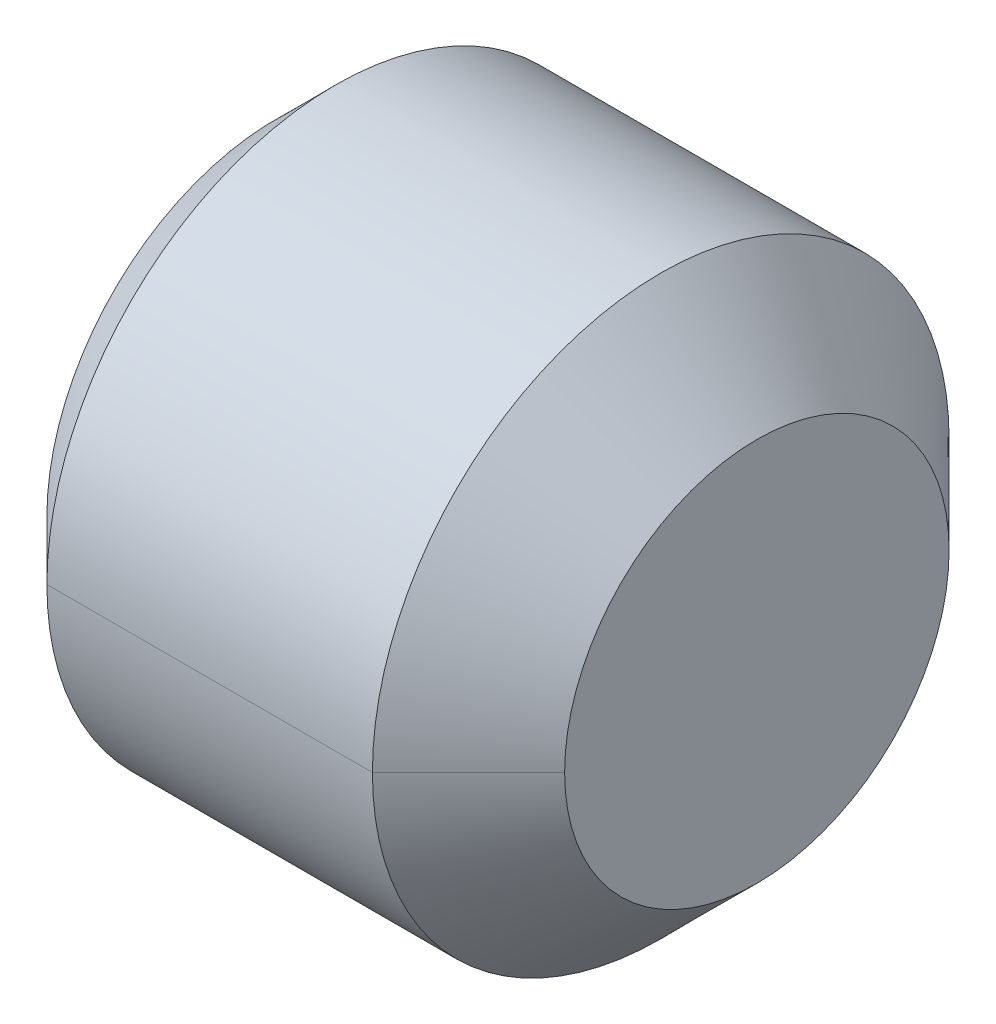
ISO-10303-21;
HEADER;
FILE_DESCRIPTION(('STEP AP214'),'2;1');
FILE_NAME('part.step','',(''),(''),'','','');
FILE_SCHEMA(('AUTOMOTIVE_DESIGN { 1 0 10303 214 1 1 1 1 }'));
ENDSEC;
DATA;
#1=APPLICATION_CONTEXT('core data for automotive mechanical design processes');
#2=APPLICATION_PROTOCOL_DEFINITION('international standard','automotive_design',2000,#1);
#3=PRODUCT_CONTEXT('',#1,'mechanical');
#4=PRODUCT('Part','Part','',(#3));
#5=PRODUCT_RELATED_PRODUCT_CATEGORY('part','',(#4));
#6=PRODUCT_DEFINITION_FORMATION('','',#4);
#7=PRODUCT_DEFINITION_CONTEXT('part definition',#1,'design');
#8=PRODUCT_DEFINITION('design','',#6,#7);
#9=PRODUCT_DEFINITION_SHAPE('','',#8);
#10=(LENGTH_UNIT() NAMED_UNIT(*) SI_UNIT(.MILLI.,.METRE.));
#11=(NAMED_UNIT(*) PLANE_ANGLE_UNIT() SI_UNIT($,.RADIAN.));
#12=(NAMED_UNIT(*) SI_UNIT($,.STERADIAN.) SOLID_ANGLE_UNIT());
#13=UNCERTAINTY_MEASURE_WITH_UNIT(LENGTH_MEASURE(1.E-05),#10,'distance_accuracy_value','');
#14=(GEOMETRIC_REPRESENTATION_CONTEXT(3) GLOBAL_UNCERTAINTY_ASSIGNED_CONTEXT((#13)) GLOBAL_UNIT_ASSIGNED_CONTEXT((#10,
#11,#12)) REPRESENTATION_CONTEXT('',''));
#15=CARTESIAN_POINT('',(0.,0.,0.));
#16=DIRECTION('',(0.,0.,1.));
#17=DIRECTION('',(1.,0.,0.));
#18=AXIS2_PLACEMENT_3D('',#15,#16,#17);
#19=CARTESIAN_POINT('',(-3.,0.,0.));
#20=DIRECTION('',(-1.,0.,0.));
#21=DIRECTION('',(0.,0.,1.));
#22=AXIS2_PLACEMENT_3D('',#19,#20,#21);
#23=PLANE('',#22);
#24=DIRECTION('',(0.,0.866025403784433,0.500000000000009));
#25=VECTOR('',#24,1.);
#26=CARTESIAN_POINT('',(-3.,-1.5,0.86602540378444));
#27=LINE('',#26,#25);
#28=CARTESIAN_POINT('',(-3.,-1.5,0.86602540378444));
#29=VERTEX_POINT('',#28);
#30=CARTESIAN_POINT('',(-3.,-0.750000000000019,1.29903810567666));
#31=VERTEX_POINT('',#30);
#32=EDGE_CURVE('E11',#29,#31,#27,.T.);
#33=ORIENTED_EDGE('',*,*,#32,.T.);
#34=CARTESIAN_POINT('',(-3.,0.,0.));
#35=DIRECTION('',(1.,0.,0.));
#36=DIRECTION('',(0.,0.,1.));
#37=AXIS2_PLACEMENT_3D('',#34,#35,#36);
#38=CIRCLE('',#37,1.5);
#39=CARTESIAN_POINT('',(-3.,-1.5,0.));
#40=VERTEX_POINT('',#39);
#41=EDGE_CURVE('E25',#31,#40,#38,.T.);
#42=ORIENTED_EDGE('',*,*,#41,.T.);
#43=DIRECTION('',(0.,0.,1.));
#44=VECTOR('',#43,1.);
#45=CARTESIAN_POINT('',(-3.,-1.5,-0.86602540378444));
#46=LINE('',#45,#44);
#47=EDGE_CURVE('E334',#40,#29,#46,.T.);
#48=ORIENTED_EDGE('',*,*,#47,.T.);
#49=EDGE_LOOP('',(#33,#42,#48));
#50=FACE_BOUND('',#49,.T.);
#51=ADVANCED_FACE('F17',(#50),#23,.T.);
#52=CARTESIAN_POINT('',(-3.,-1.5,-0.86602540378444));
#53=DIRECTION('',(0.,-1.,0.));
#54=DIRECTION('',(0.,0.,-1.));
#55=AXIS2_PLACEMENT_3D('',#52,#53,#54);
#56=PLANE('',#55);
#57=DIRECTION('',(0.,0.,1.));
#58=VECTOR('',#57,1.);
#59=CARTESIAN_POINT('',(-5.,-1.5,-0.86602540378444));
#60=LINE('',#59,#58);
#61=CARTESIAN_POINT('',(-5.,-1.5,-0.86602540378444));
#62=VERTEX_POINT('',#61);
#63=CARTESIAN_POINT('',(-5.,-1.5,0.86602540378444));
#64=VERTEX_POINT('',#63);
#65=EDGE_CURVE('E330',#62,#64,#60,.T.);
#66=ORIENTED_EDGE('',*,*,#65,.T.);
#67=DIRECTION('',(-1.,0.,0.));
#68=VECTOR('',#67,1.);
#69=CARTESIAN_POINT('',(-3.,-1.5,0.86602540378444));
#70=LINE('',#69,#68);
#71=EDGE_CURVE('E325',#29,#64,#70,.T.);
#72=ORIENTED_EDGE('',*,*,#71,.F.);
#73=ORIENTED_EDGE('',*,*,#47,.F.);
#74=DIRECTION('',(0.,0.,1.));
#75=VECTOR('',#74,1.);
#76=CARTESIAN_POINT('',(-3.,-1.5,-0.86602540378444));
#77=LINE('',#76,#75);
#78=CARTESIAN_POINT('',(-3.,-1.5,-0.86602540378444));
#79=VERTEX_POINT('',#78);
#80=EDGE_CURVE('E320',#79,#40,#77,.T.);
#81=ORIENTED_EDGE('',*,*,#80,.F.);
#82=DIRECTION('',(-1.,0.,0.));
#83=VECTOR('',#82,1.);
#84=CARTESIAN_POINT('',(-3.,-1.5,-0.86602540378444));
#85=LINE('',#84,#83);
#86=EDGE_CURVE('E316',#79,#62,#85,.T.);
#87=ORIENTED_EDGE('',*,*,#86,.T.);
#88=EDGE_LOOP('',(#66,#72,#73,#81,#87));
#89=FACE_BOUND('',#88,.T.);
#90=ADVANCED_FACE('F345',(#89),#56,.F.);
#91=CARTESIAN_POINT('',(-3.,0.,-1.7320508075689));
#92=DIRECTION('',(0.,-0.500000000000009,-0.866025403784434));
#93=DIRECTION('',(0.,0.866025403784434,-0.500000000000009));
#94=AXIS2_PLACEMENT_3D('',#91,#92,#93);
#95=PLANE('',#94);
#96=DIRECTION('',(0.,-0.866025403784433,0.500000000000009));
#97=VECTOR('',#96,1.);
#98=CARTESIAN_POINT('',(-5.,0.,-1.7320508075689));
#99=LINE('',#98,#97);
#100=CARTESIAN_POINT('',(-5.,0.,-1.7320508075689));
#101=VERTEX_POINT('',#100);
#102=EDGE_CURVE('E311',#101,#62,#99,.T.);
#103=ORIENTED_EDGE('',*,*,#102,.T.);
#104=ORIENTED_EDGE('',*,*,#86,.F.);
#105=DIRECTION('',(0.,-0.866025403784433,0.500000000000009));
#106=VECTOR('',#105,1.);
#107=CARTESIAN_POINT('',(-3.,0.,-1.7320508075689));
#108=LINE('',#107,#106);
#109=CARTESIAN_POINT('',(-3.,-0.750000000000014,-1.29903810567665));
#110=VERTEX_POINT('',#109);
#111=EDGE_CURVE('E306',#110,#79,#108,.T.);
#112=ORIENTED_EDGE('',*,*,#111,.F.);
#113=DIRECTION('',(0.,-0.866025403784433,0.500000000000009));
#114=VECTOR('',#113,1.);
#115=CARTESIAN_POINT('',(-3.,0.,-1.7320508075689));
#116=LINE('',#115,#114);
#117=CARTESIAN_POINT('',(-3.,0.,-1.7320508075689));
#118=VERTEX_POINT('',#117);
#119=EDGE_CURVE('E301',#118,#110,#116,.T.);
#120=ORIENTED_EDGE('',*,*,#119,.F.);
#121=DIRECTION('',(-1.,0.,0.));
#122=VECTOR('',#121,1.);
#123=CARTESIAN_POINT('',(-3.,0.,-1.7320508075689));
#124=LINE('',#123,#122);
#125=EDGE_CURVE('E297',#118,#101,#124,.T.);
#126=ORIENTED_EDGE('',*,*,#125,.T.);
#127=EDGE_LOOP('',(#103,#104,#112,#120,#126));
#128=FACE_BOUND('',#127,.T.);
#129=ADVANCED_FACE('F363',(#128),#95,.F.);
#130=CARTESIAN_POINT('',(-3.,1.5,-0.86602540378444));
#131=DIRECTION('',(0.,0.500000000000009,-0.866025403784434));
#132=DIRECTION('',(0.,0.866025403784434,0.500000000000009));
#133=AXIS2_PLACEMENT_3D('',#130,#131,#132);
#134=PLANE('',#133);
#135=DIRECTION('',(0.,-0.866025403784433,-0.500000000000009));
#136=VECTOR('',#135,1.);
#137=CARTESIAN_POINT('',(-5.,1.5,-0.86602540378444));
#138=LINE('',#137,#136);
#139=CARTESIAN_POINT('',(-5.,1.5,-0.86602540378444));
#140=VERTEX_POINT('',#139);
#141=EDGE_CURVE('E292',#140,#101,#138,.T.);
#142=ORIENTED_EDGE('',*,*,#141,.T.);
#143=ORIENTED_EDGE('',*,*,#125,.F.);
#144=DIRECTION('',(0.,-0.866025403784433,-0.500000000000009));
#145=VECTOR('',#144,1.);
#146=CARTESIAN_POINT('',(-3.,1.5,-0.86602540378444));
#147=LINE('',#146,#145);
#148=CARTESIAN_POINT('',(-3.,0.750000000000014,-1.29903810567665));
#149=VERTEX_POINT('',#148);
#150=EDGE_CURVE('E287',#149,#118,#147,.T.);
#151=ORIENTED_EDGE('',*,*,#150,.F.);
#152=DIRECTION('',(0.,-0.866025403784433,-0.500000000000009));
#153=VECTOR('',#152,1.);
#154=CARTESIAN_POINT('',(-3.,1.5,-0.86602540378444));
#155=LINE('',#154,#153);
#156=CARTESIAN_POINT('',(-3.,1.5,-0.86602540378444));
#157=VERTEX_POINT('',#156);
#158=EDGE_CURVE('E282',#157,#149,#155,.T.);
#159=ORIENTED_EDGE('',*,*,#158,.F.);
#160=DIRECTION('',(-1.,0.,0.));
#161=VECTOR('',#160,1.);
#162=CARTESIAN_POINT('',(-3.,1.5,-0.86602540378444));
#163=LINE('',#162,#161);
#164=EDGE_CURVE('E278',#157,#140,#163,.T.);
#165=ORIENTED_EDGE('',*,*,#164,.T.);
#166=EDGE_LOOP('',(#142,#143,#151,#159,#165));
#167=FACE_BOUND('',#166,.T.);
#168=ADVANCED_FACE('F383',(#167),#134,.F.);
#169=CARTESIAN_POINT('',(-3.,1.5,0.86602540378444));
#170=DIRECTION('',(0.,1.,0.));
#171=DIRECTION('',(0.,0.,1.));
#172=AXIS2_PLACEMENT_3D('',#169,#170,#171);
#173=PLANE('',#172);
#174=DIRECTION('',(-1.,0.,0.));
#175=VECTOR('',#174,1.);
#176=CARTESIAN_POINT('',(-3.,1.5,0.86602540378444));
#177=LINE('',#176,#175);
#178=CARTESIAN_POINT('',(-3.,1.5,0.86602540378444));
#179=VERTEX_POINT('',#178);
#180=CARTESIAN_POINT('',(-5.,1.5,0.86602540378444));
#181=VERTEX_POINT('',#180);
#182=EDGE_CURVE('E274',#179,#181,#177,.T.);
#183=ORIENTED_EDGE('',*,*,#182,.T.);
#184=DIRECTION('',(0.,0.,1.));
#185=VECTOR('',#184,1.);
#186=CARTESIAN_POINT('',(-5.,1.5,0.));
#187=LINE('',#186,#185);
#188=EDGE_CURVE('E269',#140,#181,#187,.T.);
#189=ORIENTED_EDGE('',*,*,#188,.F.);
#190=ORIENTED_EDGE('',*,*,#164,.F.);
#191=DIRECTION('',(0.,0.,-1.));
#192=VECTOR('',#191,1.);
#193=CARTESIAN_POINT('',(-3.,1.5,0.86602540378444));
#194=LINE('',#193,#192);
#195=CARTESIAN_POINT('',(-3.,1.5,0.));
#196=VERTEX_POINT('',#195);
#197=EDGE_CURVE('E264',#196,#157,#194,.T.);
#198=ORIENTED_EDGE('',*,*,#197,.F.);
#199=DIRECTION('',(0.,0.,-1.));
#200=VECTOR('',#199,1.);
#201=CARTESIAN_POINT('',(-3.,1.5,0.86602540378444));
#202=LINE('',#201,#200);
#203=EDGE_CURVE('E259',#179,#196,#202,.T.);
#204=ORIENTED_EDGE('',*,*,#203,.F.);
#205=EDGE_LOOP('',(#183,#189,#190,#198,#204));
#206=FACE_BOUND('',#205,.T.);
#207=ADVANCED_FACE('F386',(#206),#173,.F.);
#208=CARTESIAN_POINT('',(-3.,0.,0.));
#209=DIRECTION('',(-1.,0.,0.));
#210=DIRECTION('',(0.,0.,1.));
#211=AXIS2_PLACEMENT_3D('',#208,#209,#210);
#212=PLANE('',#211);
#213=ORIENTED_EDGE('',*,*,#203,.T.);
#214=CARTESIAN_POINT('',(-3.,0.,0.));
#215=DIRECTION('',(1.,0.,0.));
#216=DIRECTION('',(0.,0.,-1.));
#217=AXIS2_PLACEMENT_3D('',#214,#215,#216);
#218=CIRCLE('',#217,1.5);
#219=CARTESIAN_POINT('',(-3.,0.750000000000014,1.29903810567665));
#220=VERTEX_POINT('',#219);
#221=EDGE_CURVE('E255',#196,#220,#218,.T.);
#222=ORIENTED_EDGE('',*,*,#221,.T.);
#223=DIRECTION('',(0.,0.866025403784433,-0.500000000000009));
#224=VECTOR('',#223,1.);
#225=CARTESIAN_POINT('',(-3.,0.,1.7320508075689));
#226=LINE('',#225,#224);
#227=EDGE_CURVE('E250',#220,#179,#226,.T.);
#228=ORIENTED_EDGE('',*,*,#227,.T.);
#229=EDGE_LOOP('',(#213,#222,#228));
#230=FACE_BOUND('',#229,.T.);
#231=ADVANCED_FACE('F388',(#230),#212,.T.);
#232=CARTESIAN_POINT('',(-3.,0.,1.7320508075689));
#233=DIRECTION('',(0.,0.500000000000009,0.866025403784434));
#234=DIRECTION('',(0.,-0.866025403784434,0.500000000000009));
#235=AXIS2_PLACEMENT_3D('',#232,#233,#234);
#236=PLANE('',#235);
#237=DIRECTION('',(0.,0.866025403784433,-0.500000000000009));
#238=VECTOR('',#237,1.);
#239=CARTESIAN_POINT('',(-5.,0.,1.7320508075689));
#240=LINE('',#239,#238);
#241=CARTESIAN_POINT('',(-5.,0.,1.7320508075689));
#242=VERTEX_POINT('',#241);
#243=EDGE_CURVE('E245',#242,#181,#240,.T.);
#244=ORIENTED_EDGE('',*,*,#243,.T.);
#245=ORIENTED_EDGE('',*,*,#182,.F.);
#246=ORIENTED_EDGE('',*,*,#227,.F.);
#247=DIRECTION('',(0.,0.866025403784433,-0.500000000000009));
#248=VECTOR('',#247,1.);
#249=CARTESIAN_POINT('',(-3.,0.,1.7320508075689));
#250=LINE('',#249,#248);
#251=CARTESIAN_POINT('',(-3.,0.,1.7320508075689));
#252=VERTEX_POINT('',#251);
#253=EDGE_CURVE('E240',#252,#220,#250,.T.);
#254=ORIENTED_EDGE('',*,*,#253,.F.);
#255=DIRECTION('',(-1.,0.,0.));
#256=VECTOR('',#255,1.);
#257=CARTESIAN_POINT('',(-3.,0.,1.7320508075689));
#258=LINE('',#257,#256);
#259=EDGE_CURVE('E236',#252,#242,#258,.T.);
#260=ORIENTED_EDGE('',*,*,#259,.T.);
#261=EDGE_LOOP('',(#244,#245,#246,#254,#260));
#262=FACE_BOUND('',#261,.T.);
#263=ADVANCED_FACE('F372',(#262),#236,.F.);
#264=CARTESIAN_POINT('',(-3.,-1.5,0.86602540378444));
#265=DIRECTION('',(0.,-0.500000000000009,0.866025403784434));
#266=DIRECTION('',(0.,-0.866025403784434,-0.500000000000009));
#267=AXIS2_PLACEMENT_3D('',#264,#265,#266);
#268=PLANE('',#267);
#269=DIRECTION('',(0.,0.866025403784433,0.500000000000009));
#270=VECTOR('',#269,1.);
#271=CARTESIAN_POINT('',(-5.,-1.5,0.86602540378444));
#272=LINE('',#271,#270);
#273=EDGE_CURVE('E231',#64,#242,#272,.T.);
#274=ORIENTED_EDGE('',*,*,#273,.T.);
#275=ORIENTED_EDGE('',*,*,#259,.F.);
#276=DIRECTION('',(0.,0.866025403784433,0.500000000000009));
#277=VECTOR('',#276,1.);
#278=CARTESIAN_POINT('',(-3.,-1.5,0.86602540378444));
#279=LINE('',#278,#277);
#280=EDGE_CURVE('E226',#31,#252,#279,.T.);
#281=ORIENTED_EDGE('',*,*,#280,.F.);
#282=ORIENTED_EDGE('',*,*,#32,.F.);
#283=ORIENTED_EDGE('',*,*,#71,.T.);
#284=EDGE_LOOP('',(#274,#275,#281,#282,#283));
#285=FACE_BOUND('',#284,.T.);
#286=ADVANCED_FACE('F349',(#285),#268,.F.);
#287=CARTESIAN_POINT('',(-3.,0.,0.));
#288=DIRECTION('',(-1.,0.,0.));
#289=DIRECTION('',(0.,0.,1.));
#290=AXIS2_PLACEMENT_3D('',#287,#288,#289);
#291=PLANE('',#290);
#292=ORIENTED_EDGE('',*,*,#253,.T.);
#293=CARTESIAN_POINT('',(-3.,0.,0.));
#294=DIRECTION('',(1.,0.,0.));
#295=DIRECTION('',(0.,0.,1.));
#296=AXIS2_PLACEMENT_3D('',#293,#294,#295);
#297=CIRCLE('',#296,1.5);
#298=CARTESIAN_POINT('',(-3.,0.,1.5));
#299=VERTEX_POINT('',#298);
#300=EDGE_CURVE('E222',#220,#299,#297,.T.);
#301=ORIENTED_EDGE('',*,*,#300,.T.);
#302=CARTESIAN_POINT('',(-3.,0.,0.));
#303=DIRECTION('',(1.,0.,0.));
#304=DIRECTION('',(0.,0.,1.));
#305=AXIS2_PLACEMENT_3D('',#302,#303,#304);
#306=CIRCLE('',#305,1.5);
#307=EDGE_CURVE('E217',#299,#31,#306,.T.);
#308=ORIENTED_EDGE('',*,*,#307,.T.);
#309=ORIENTED_EDGE('',*,*,#280,.T.);
#310=EDGE_LOOP('',(#292,#301,#308,#309));
#311=FACE_BOUND('',#310,.T.);
#312=ADVANCED_FACE('F353',(#311),#291,.T.);
#313=CARTESIAN_POINT('',(-3.,0.,0.));
#314=DIRECTION('',(-1.,0.,0.));
#315=DIRECTION('',(0.,1.,0.));
#316=AXIS2_PLACEMENT_3D('',#313,#314,#315);
#317=CONICAL_SURFACE('',#316,1.5,1.04719755119662);
#318=DIRECTION('',(-0.499999999999983,0.,-0.866025403784448));
#319=VECTOR('',#318,1.);
#320=CARTESIAN_POINT('',(-2.1339745962156,0.,0.));
#321=LINE('',#320,#319);
#322=CARTESIAN_POINT('',(-2.1339745962156,0.,0.));
#323=VERTEX_POINT('',#322);
#324=CARTESIAN_POINT('',(-3.,0.,-1.5));
#325=VERTEX_POINT('',#324);
#326=EDGE_CURVE('E213',#323,#325,#321,.T.);
#327=ORIENTED_EDGE('',*,*,#326,.T.);
#328=CARTESIAN_POINT('',(-3.,0.,0.));
#329=DIRECTION('',(1.,0.,0.));
#330=DIRECTION('',(0.,0.,1.));
#331=AXIS2_PLACEMENT_3D('',#328,#329,#330);
#332=CIRCLE('',#331,1.5);
#333=EDGE_CURVE('E208',#110,#325,#332,.T.);
#334=ORIENTED_EDGE('',*,*,#333,.F.);
#335=CARTESIAN_POINT('',(-3.,0.,0.));
#336=DIRECTION('',(1.,0.,0.));
#337=DIRECTION('',(0.,0.,1.));
#338=AXIS2_PLACEMENT_3D('',#335,#336,#337);
#339=CIRCLE('',#338,1.5);
#340=EDGE_CURVE('E203',#40,#110,#339,.T.);
#341=ORIENTED_EDGE('',*,*,#340,.F.);
#342=ORIENTED_EDGE('',*,*,#41,.F.);
#343=ORIENTED_EDGE('',*,*,#307,.F.);
#344=DIRECTION('',(-0.499999999999983,0.,0.866025403784448));
#345=VECTOR('',#344,1.);
#346=CARTESIAN_POINT('',(-2.1339745962156,0.,0.));
#347=LINE('',#346,#345);
#348=EDGE_CURVE('E198',#323,#299,#347,.T.);
#349=ORIENTED_EDGE('',*,*,#348,.F.);
#350=EDGE_LOOP('',(#327,#334,#341,#342,#343,#349));
#351=FACE_BOUND('',#350,.T.);
#352=ADVANCED_FACE('F356',(#351),#317,.F.);
#353=CARTESIAN_POINT('',(-3.,0.,0.));
#354=DIRECTION('',(-1.,0.,0.));
#355=DIRECTION('',(0.,-1.,0.));
#356=AXIS2_PLACEMENT_3D('',#353,#354,#355);
#357=CONICAL_SURFACE('',#356,1.5,1.04719755119662);
#358=ORIENTED_EDGE('',*,*,#348,.T.);
#359=ORIENTED_EDGE('',*,*,#300,.F.);
#360=ORIENTED_EDGE('',*,*,#221,.F.);
#361=CARTESIAN_POINT('',(-3.,0.,0.));
#362=DIRECTION('',(1.,0.,0.));
#363=DIRECTION('',(0.,0.,1.));
#364=AXIS2_PLACEMENT_3D('',#361,#362,#363);
#365=CIRCLE('',#364,1.5);
#366=EDGE_CURVE('E193',#149,#196,#365,.T.);
#367=ORIENTED_EDGE('',*,*,#366,.F.);
#368=CARTESIAN_POINT('',(-3.,0.,0.));
#369=DIRECTION('',(1.,0.,0.));
#370=DIRECTION('',(0.,0.,1.));
#371=AXIS2_PLACEMENT_3D('',#368,#369,#370);
#372=CIRCLE('',#371,1.5);
#373=EDGE_CURVE('E188',#325,#149,#372,.T.);
#374=ORIENTED_EDGE('',*,*,#373,.F.);
#375=ORIENTED_EDGE('',*,*,#326,.F.);
#376=EDGE_LOOP('',(#358,#359,#360,#367,#374,#375));
#377=FACE_BOUND('',#376,.T.);
#378=ADVANCED_FACE('F376',(#377),#357,.F.);
#379=CARTESIAN_POINT('',(-3.,0.,0.));
#380=DIRECTION('',(-1.,0.,0.));
#381=DIRECTION('',(0.,0.,1.));
#382=AXIS2_PLACEMENT_3D('',#379,#380,#381);
#383=PLANE('',#382);
#384=ORIENTED_EDGE('',*,*,#119,.T.);
#385=ORIENTED_EDGE('',*,*,#333,.T.);
#386=ORIENTED_EDGE('',*,*,#373,.T.);
#387=ORIENTED_EDGE('',*,*,#150,.T.);
#388=EDGE_LOOP('',(#384,#385,#386,#387));
#389=FACE_BOUND('',#388,.T.);
#390=ADVANCED_FACE('F381',(#389),#383,.T.);
#391=CARTESIAN_POINT('',(-3.,0.,0.));
#392=DIRECTION('',(-1.,0.,0.));
#393=DIRECTION('',(0.,0.,1.));
#394=AXIS2_PLACEMENT_3D('',#391,#392,#393);
#395=PLANE('',#394);
#396=ORIENTED_EDGE('',*,*,#158,.T.);
#397=ORIENTED_EDGE('',*,*,#366,.T.);
#398=ORIENTED_EDGE('',*,*,#197,.T.);
#399=EDGE_LOOP('',(#396,#397,#398));
#400=FACE_BOUND('',#399,.T.);
#401=ADVANCED_FACE('F479',(#400),#395,.T.);
#402=CARTESIAN_POINT('',(-3.,0.,0.));
#403=DIRECTION('',(-1.,0.,0.));
#404=DIRECTION('',(0.,0.,1.));
#405=AXIS2_PLACEMENT_3D('',#402,#403,#404);
#406=PLANE('',#405);
#407=ORIENTED_EDGE('',*,*,#80,.T.);
#408=ORIENTED_EDGE('',*,*,#340,.T.);
#409=ORIENTED_EDGE('',*,*,#111,.T.);
#410=EDGE_LOOP('',(#407,#408,#409));
#411=FACE_BOUND('',#410,.T.);
#412=ADVANCED_FACE('F359',(#411),#406,.T.);
#413=CARTESIAN_POINT('',(-5.,0.,0.));
#414=DIRECTION('',(1.,0.,0.));
#415=DIRECTION('',(0.,0.,-1.));
#416=AXIS2_PLACEMENT_3D('',#413,#414,#415);
#417=PLANE('',#416);
#418=CARTESIAN_POINT('',(-5.,0.,0.));
#419=DIRECTION('',(1.,0.,0.));
#420=DIRECTION('',(0.,0.,-1.));
#421=AXIS2_PLACEMENT_3D('',#418,#419,#420);
#422=CIRCLE('',#421,2.3865);
#423=CARTESIAN_POINT('',(-5.,0.,2.3865));
#424=VERTEX_POINT('',#423);
#425=CARTESIAN_POINT('',(-5.,0.,-2.3865));
#426=VERTEX_POINT('',#425);
#427=EDGE_CURVE('E183',#424,#426,#422,.T.);
#428=ORIENTED_EDGE('',*,*,#427,.F.);
#429=CARTESIAN_POINT('',(-5.,0.,0.));
#430=DIRECTION('',(1.,0.,0.));
#431=DIRECTION('',(0.,0.,-1.));
#432=AXIS2_PLACEMENT_3D('',#429,#430,#431);
#433=CIRCLE('',#432,2.3865);
#434=EDGE_CURVE('E178',#426,#424,#433,.T.);
#435=ORIENTED_EDGE('',*,*,#434,.F.);
#436=EDGE_LOOP('',(#428,#435));
#437=FACE_BOUND('',#436,.T.);
#438=ORIENTED_EDGE('',*,*,#243,.F.);
#439=ORIENTED_EDGE('',*,*,#273,.F.);
#440=ORIENTED_EDGE('',*,*,#65,.F.);
#441=ORIENTED_EDGE('',*,*,#102,.F.);
#442=ORIENTED_EDGE('',*,*,#141,.F.);
#443=ORIENTED_EDGE('',*,*,#188,.T.);
#444=EDGE_LOOP('',(#438,#439,#440,#441,#442,#443));
#445=FACE_BOUND('',#444,.T.);
#446=ADVANCED_FACE('F368',(#437,#445),#417,.F.);
#447=CARTESIAN_POINT('',(-5.,0.,0.));
#448=DIRECTION('',(1.,0.,0.));
#449=DIRECTION('',(0.,-1.,0.));
#450=AXIS2_PLACEMENT_3D('',#447,#448,#449);
#451=CONICAL_SURFACE('',#450,2.3865,0.785398163397448);
#452=DIRECTION('',(0.707106781186547,0.,0.707106781186548));
#453=VECTOR('',#452,1.);
#454=CARTESIAN_POINT('',(-5.,0.,2.3865));
#455=LINE('',#454,#453);
#456=CARTESIAN_POINT('',(-4.3865,0.,3.));
#457=VERTEX_POINT('',#456);
#458=EDGE_CURVE('E174',#424,#457,#455,.T.);
#459=ORIENTED_EDGE('',*,*,#458,.T.);
#460=CARTESIAN_POINT('',(-4.3865,0.,0.));
#461=DIRECTION('',(1.,0.,0.));
#462=DIRECTION('',(0.,0.,-1.));
#463=AXIS2_PLACEMENT_3D('',#460,#461,#462);
#464=CIRCLE('',#463,3.);
#465=CARTESIAN_POINT('',(-4.3865,0.,-3.));
#466=VERTEX_POINT('',#465);
#467=EDGE_CURVE('E169',#466,#457,#464,.T.);
#468=ORIENTED_EDGE('',*,*,#467,.F.);
#469=DIRECTION('',(0.707106781186547,0.,-0.707106781186548));
#470=VECTOR('',#469,1.);
#471=CARTESIAN_POINT('',(-5.,0.,-2.3865));
#472=LINE('',#471,#470);
#473=EDGE_CURVE('E164',#426,#466,#472,.T.);
#474=ORIENTED_EDGE('',*,*,#473,.F.);
#475=ORIENTED_EDGE('',*,*,#434,.T.);
#476=EDGE_LOOP('',(#459,#468,#474,#475));
#477=FACE_BOUND('',#476,.T.);
#478=ADVANCED_FACE('F508',(#477),#451,.T.);
#479=CARTESIAN_POINT('',(-5.,0.,0.));
#480=DIRECTION('',(1.,0.,0.));
#481=DIRECTION('',(0.,1.,0.));
#482=AXIS2_PLACEMENT_3D('',#479,#480,#481);
#483=CONICAL_SURFACE('',#482,2.3865,0.785398163397448);
#484=ORIENTED_EDGE('',*,*,#458,.F.);
#485=ORIENTED_EDGE('',*,*,#427,.T.);
#486=ORIENTED_EDGE('',*,*,#473,.T.);
#487=CARTESIAN_POINT('',(-4.3865,0.,0.));
#488=DIRECTION('',(1.,0.,0.));
#489=DIRECTION('',(0.,0.,-1.));
#490=AXIS2_PLACEMENT_3D('',#487,#488,#489);
#491=CIRCLE('',#490,3.);
#492=EDGE_CURVE('E159',#457,#466,#491,.T.);
#493=ORIENTED_EDGE('',*,*,#492,.F.);
#494=EDGE_LOOP('',(#484,#485,#486,#493));
#495=FACE_BOUND('',#494,.T.);
#496=ADVANCED_FACE('F519',(#495),#483,.T.);
#497=CARTESIAN_POINT('',(0.,0.,0.));
#498=DIRECTION('',(1.,0.,0.));
#499=DIRECTION('',(0.,1.,-1.61702923845784E-09));
#500=AXIS2_PLACEMENT_3D('',#497,#498,#499);
#501=CYLINDRICAL_SURFACE('',#500,3.);
#502=DIRECTION('',(1.,0.,0.));
#503=VECTOR('',#502,1.);
#504=CARTESIAN_POINT('',(-4.3865,0.,3.));
#505=LINE('',#504,#503);
#506=CARTESIAN_POINT('',(-1.,0.,3.));
#507=VERTEX_POINT('',#506);
#508=EDGE_CURVE('E154',#457,#507,#505,.T.);
#509=ORIENTED_EDGE('',*,*,#508,.F.);
#510=ORIENTED_EDGE('',*,*,#492,.T.);
#511=DIRECTION('',(1.,0.,0.));
#512=VECTOR('',#511,1.);
#513=CARTESIAN_POINT('',(-4.3865,0.,-3.));
#514=LINE('',#513,#512);
#515=CARTESIAN_POINT('',(-1.,0.,-3.));
#516=VERTEX_POINT('',#515);
#517=EDGE_CURVE('E150',#466,#516,#514,.T.);
#518=ORIENTED_EDGE('',*,*,#517,.T.);
#519=CARTESIAN_POINT('',(-1.,0.,0.));
#520=DIRECTION('',(1.,0.,0.));
#521=DIRECTION('',(0.,0.,-1.));
#522=AXIS2_PLACEMENT_3D('',#519,#520,#521);
#523=CIRCLE('',#522,3.);
#524=EDGE_CURVE('E146',#507,#516,#523,.T.);
#525=ORIENTED_EDGE('',*,*,#524,.F.);
#526=EDGE_LOOP('',(#509,#510,#518,#525));
#527=FACE_BOUND('',#526,.T.);
#528=ADVANCED_FACE('F530',(#527),#501,.T.);
#529=CARTESIAN_POINT('',(-1.,0.,0.));
#530=DIRECTION('',(-1.,0.,0.));
#531=DIRECTION('',(0.,1.,0.));
#532=AXIS2_PLACEMENT_3D('',#529,#530,#531);
#533=CONICAL_SURFACE('',#532,3.,0.785398163397448);
#534=DIRECTION('',(-0.707106781186548,0.,-0.707106781186548));
#535=VECTOR('',#534,1.);
#536=CARTESIAN_POINT('',(0.,0.,-2.));
#537=LINE('',#536,#535);
#538=CARTESIAN_POINT('',(0.,0.,-2.));
#539=VERTEX_POINT('',#538);
#540=EDGE_CURVE('E124',#539,#516,#537,.T.);
#541=ORIENTED_EDGE('',*,*,#540,.F.);
#542=CARTESIAN_POINT('',(0.,0.,0.));
#543=DIRECTION('',(1.,0.,0.));
#544=DIRECTION('',(0.,0.,-1.));
#545=AXIS2_PLACEMENT_3D('',#542,#543,#544);
#546=CIRCLE('',#545,2.);
#547=CARTESIAN_POINT('',(0.,0.,2.));
#548=VERTEX_POINT('',#547);
#549=EDGE_CURVE('E117',#548,#539,#546,.T.);
#550=ORIENTED_EDGE('',*,*,#549,.F.);
#551=DIRECTION('',(-0.707106781186548,0.,0.707106781186548));
#552=VECTOR('',#551,1.);
#553=CARTESIAN_POINT('',(0.,0.,2.));
#554=LINE('',#553,#552);
#555=EDGE_CURVE('E122',#548,#507,#554,.T.);
#556=ORIENTED_EDGE('',*,*,#555,.T.);
#557=ORIENTED_EDGE('',*,*,#524,.T.);
#558=EDGE_LOOP('',(#541,#550,#556,#557));
#559=FACE_BOUND('',#558,.T.);
#560=ADVANCED_FACE('F119',(#559),#533,.T.);
#561=CARTESIAN_POINT('',(-1.,0.,0.));
#562=DIRECTION('',(-1.,0.,0.));
#563=DIRECTION('',(0.,-1.,0.));
#564=AXIS2_PLACEMENT_3D('',#561,#562,#563);
#565=CONICAL_SURFACE('',#564,3.,0.785398163397448);
#566=ORIENTED_EDGE('',*,*,#540,.T.);
#567=CARTESIAN_POINT('',(-1.,0.,0.));
#568=DIRECTION('',(1.,0.,0.));
#569=DIRECTION('',(0.,0.,-1.));
#570=AXIS2_PLACEMENT_3D('',#567,#568,#569);
#571=CIRCLE('',#570,3.);
#572=EDGE_CURVE('E131',#516,#507,#571,.T.);
#573=ORIENTED_EDGE('',*,*,#572,.T.);
#574=ORIENTED_EDGE('',*,*,#555,.F.);
#575=CARTESIAN_POINT('',(0.,0.,0.));
#576=DIRECTION('',(1.,0.,0.));
#577=DIRECTION('',(0.,0.,-1.));
#578=AXIS2_PLACEMENT_3D('',#575,#576,#577);
#579=CIRCLE('',#578,2.);
#580=EDGE_CURVE('E128',#539,#548,#579,.T.);
#581=ORIENTED_EDGE('',*,*,#580,.F.);
#582=EDGE_LOOP('',(#566,#573,#574,#581));
#583=FACE_BOUND('',#582,.T.);
#584=ADVANCED_FACE('F134',(#583),#565,.T.);
#585=CARTESIAN_POINT('',(0.,2.,0.));
#586=DIRECTION('',(-1.,0.,0.));
#587=DIRECTION('',(0.,0.,1.));
#588=AXIS2_PLACEMENT_3D('',#585,#586,#587);
#589=PLANE('',#588);
#590=ORIENTED_EDGE('',*,*,#580,.T.);
#591=ORIENTED_EDGE('',*,*,#549,.T.);
#592=EDGE_LOOP('',(#590,#591));
#593=FACE_BOUND('',#592,.T.);
#594=ADVANCED_FACE('F129',(#593),#589,.F.);
#595=CARTESIAN_POINT('',(0.,0.,0.));
#596=DIRECTION('',(1.,0.,0.));
#597=DIRECTION('',(0.,-1.,0.));
#598=AXIS2_PLACEMENT_3D('',#595,#596,#597);
#599=CYLINDRICAL_SURFACE('',#598,3.);
#600=ORIENTED_EDGE('',*,*,#508,.T.);
#601=ORIENTED_EDGE('',*,*,#572,.F.);
#602=ORIENTED_EDGE('',*,*,#517,.F.);
#603=ORIENTED_EDGE('',*,*,#467,.T.);
#604=EDGE_LOOP('',(#600,#601,#602,#603));
#605=FACE_BOUND('',#604,.T.);
#606=ADVANCED_FACE('F569',(#605),#599,.T.);
#607=CLOSED_SHELL('',(#51,#90,#129,#168,#207,#231,#263,#286,#312,#352,#378,#390,#401,#412,#446,
#478,#496,#528,#560,#584,#594,#606));
#608=MANIFOLD_SOLID_BREP('B1',#607);
#609=ADVANCED_BREP_SHAPE_REPRESENTATION('',(#18,#608),#14);
#610=SHAPE_DEFINITION_REPRESENTATION(#9,#609);
ENDSEC;
END-ISO-10303-21;
